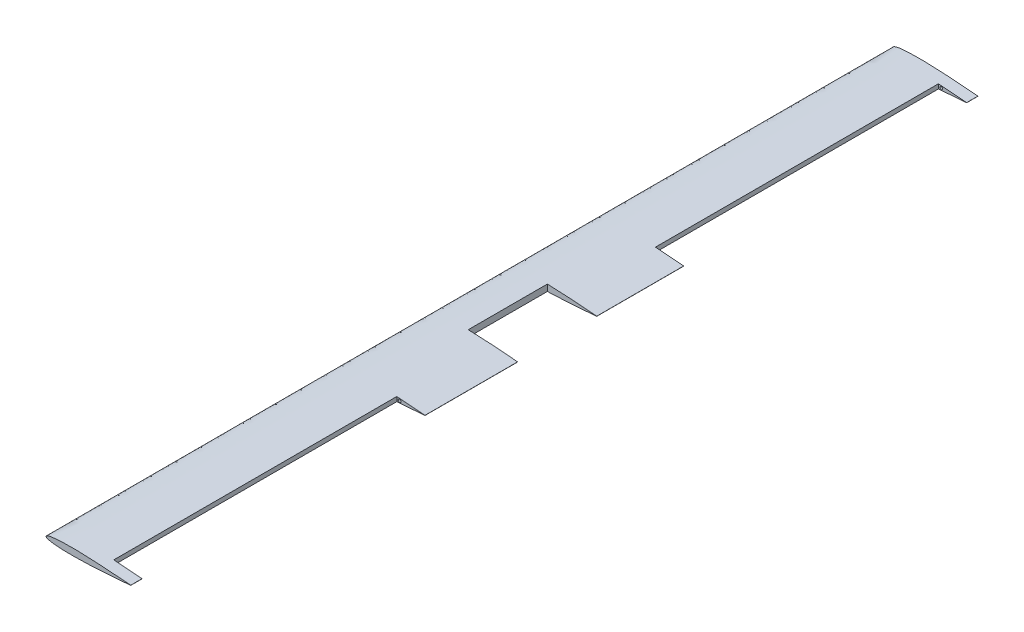
ISO-10303-21;
HEADER;
FILE_DESCRIPTION(('STEP AP214'),'2;1');
FILE_NAME('part.step','',(''),(''),'','','');
FILE_SCHEMA(('AUTOMOTIVE_DESIGN { 1 0 10303 214 1 1 1 1 }'));
ENDSEC;
DATA;
#1=APPLICATION_CONTEXT('core data for automotive mechanical design processes');
#2=APPLICATION_PROTOCOL_DEFINITION('international standard','automotive_design',2000,#1);
#3=PRODUCT_CONTEXT('',#1,'mechanical');
#4=PRODUCT('Part','Part','',(#3));
#5=PRODUCT_RELATED_PRODUCT_CATEGORY('part','',(#4));
#6=PRODUCT_DEFINITION_FORMATION('','',#4);
#7=PRODUCT_DEFINITION_CONTEXT('part definition',#1,'design');
#8=PRODUCT_DEFINITION('design','',#6,#7);
#9=PRODUCT_DEFINITION_SHAPE('','',#8);
#10=(LENGTH_UNIT() NAMED_UNIT(*) SI_UNIT(.MILLI.,.METRE.));
#11=(NAMED_UNIT(*) PLANE_ANGLE_UNIT() SI_UNIT($,.RADIAN.));
#12=(NAMED_UNIT(*) SI_UNIT($,.STERADIAN.) SOLID_ANGLE_UNIT());
#13=UNCERTAINTY_MEASURE_WITH_UNIT(LENGTH_MEASURE(1.E-05),#10,'distance_accuracy_value','');
#14=(GEOMETRIC_REPRESENTATION_CONTEXT(3) GLOBAL_UNCERTAINTY_ASSIGNED_CONTEXT((#13)) GLOBAL_UNIT_ASSIGNED_CONTEXT((#10,
#11,#12)) REPRESENTATION_CONTEXT('',''));
#15=CARTESIAN_POINT('',(0.,0.,0.));
#16=DIRECTION('',(0.,0.,1.));
#17=DIRECTION('',(1.,0.,0.));
#18=AXIS2_PLACEMENT_3D('',#15,#16,#17);
#19=CARTESIAN_POINT('',(87.2529979779286,0.00032362709043763,755.));
#20=DIRECTION('',(0.,0.,-1.));
#21=DIRECTION('',(-1.,0.,0.));
#22=AXIS2_PLACEMENT_3D('',#19,#20,#21);
#23=CYLINDRICAL_SURFACE('',#22,0.178190908859033);
#24=DIRECTION('',(0.,0.,-1.));
#25=VECTOR('',#24,1.);
#26=CARTESIAN_POINT('',(87.3789979779286,0.126323627090438,755.));
#27=LINE('',#26,#25);
#28=CARTESIAN_POINT('',(87.3789979779286,0.126323627090438,-70.0000000000001));
#29=VERTEX_POINT('',#28);
#30=CARTESIAN_POINT('',(87.3789979779286,0.126323627090441,-224.));
#31=VERTEX_POINT('',#30);
#32=EDGE_CURVE('E90',#29,#31,#27,.T.);
#33=ORIENTED_EDGE('',*,*,#32,.F.);
#34=CARTESIAN_POINT('',(87.2529979779286,0.00032362709043763,-70.0000000000001));
#35=DIRECTION('',(0.,0.,-1.));
#36=DIRECTION('',(-1.,0.,0.));
#37=AXIS2_PLACEMENT_3D('',#34,#35,#36);
#38=CIRCLE('',#37,0.178190908859033);
#39=CARTESIAN_POINT('',(87.3789979779286,-0.125676372909566,-70.0000000000001));
#40=VERTEX_POINT('',#39);
#41=EDGE_CURVE('E174',#29,#40,#38,.T.);
#42=ORIENTED_EDGE('',*,*,#41,.T.);
#43=DIRECTION('',(0.,0.,-1.));
#44=VECTOR('',#43,1.);
#45=CARTESIAN_POINT('',(87.3789979779286,-0.125676372909562,755.));
#46=LINE('',#45,#44);
#47=CARTESIAN_POINT('',(87.3789979779286,-0.125676372909566,-224.));
#48=VERTEX_POINT('',#47);
#49=EDGE_CURVE('E120',#40,#48,#46,.T.);
#50=ORIENTED_EDGE('',*,*,#49,.T.);
#51=CARTESIAN_POINT('',(87.2529979779286,0.00032362709043763,-224.));
#52=DIRECTION('',(0.,0.,1.));
#53=DIRECTION('',(1.,0.,0.));
#54=AXIS2_PLACEMENT_3D('',#51,#52,#53);
#55=CIRCLE('',#54,0.178190908859033);
#56=EDGE_CURVE('E178',#48,#31,#55,.T.);
#57=ORIENTED_EDGE('',*,*,#56,.T.);
#58=EDGE_LOOP('',(#33,#42,#50,#57));
#59=FACE_BOUND('',#58,.T.);
#60=ADVANCED_FACE('F38',(#59),#23,.T.);
#61=CARTESIAN_POINT('',(87.2529979779286,0.00032362709043763,-725.));
#62=DIRECTION('',(0.,0.,1.));
#63=DIRECTION('',(1.,0.,0.));
#64=AXIS2_PLACEMENT_3D('',#61,#62,#63);
#65=CIRCLE('',#64,0.178190908859033);
#66=CARTESIAN_POINT('',(87.3789979779286,-0.125676372909566,-725.));
#67=VERTEX_POINT('',#66);
#68=CARTESIAN_POINT('',(87.3789979779286,0.126323627090441,-725.));
#69=VERTEX_POINT('',#68);
#70=EDGE_CURVE('E186',#67,#69,#65,.T.);
#71=ORIENTED_EDGE('',*,*,#70,.F.);
#72=CARTESIAN_POINT('',(87.3789979779286,-0.125676372909562,-745.));
#73=VERTEX_POINT('',#72);
#74=EDGE_CURVE('E96',#67,#73,#46,.T.);
#75=ORIENTED_EDGE('',*,*,#74,.T.);
#76=CARTESIAN_POINT('',(87.2529979779286,0.00032362709043763,-745.));
#77=DIRECTION('',(0.,0.,1.));
#78=DIRECTION('',(-1.,0.,0.));
#79=AXIS2_PLACEMENT_3D('',#76,#77,#78);
#80=CIRCLE('',#79,0.178190908859033);
#81=CARTESIAN_POINT('',(87.3789979779286,0.126323627090438,-745.));
#82=VERTEX_POINT('',#81);
#83=EDGE_CURVE('E94',#73,#82,#80,.T.);
#84=ORIENTED_EDGE('',*,*,#83,.T.);
#85=EDGE_CURVE('E78',#69,#82,#27,.T.);
#86=ORIENTED_EDGE('',*,*,#85,.F.);
#87=EDGE_LOOP('',(#71,#75,#84,#86));
#88=FACE_BOUND('',#87,.T.);
#89=ADVANCED_FACE('F95',(#88),#23,.T.);
#90=CARTESIAN_POINT('',(87.3789979779286,-0.125676372909566,234.));
#91=VERTEX_POINT('',#90);
#92=CARTESIAN_POINT('',(87.3789979779286,-0.125676372909562,70.0000000000001));
#93=VERTEX_POINT('',#92);
#94=EDGE_CURVE('E119',#91,#93,#46,.T.);
#95=ORIENTED_EDGE('',*,*,#94,.T.);
#96=CARTESIAN_POINT('',(87.2529979779286,0.00032362709043763,70.0000000000001));
#97=DIRECTION('',(0.,0.,1.));
#98=DIRECTION('',(1.,0.,0.));
#99=AXIS2_PLACEMENT_3D('',#96,#97,#98);
#100=CIRCLE('',#99,0.178190908859033);
#101=CARTESIAN_POINT('',(87.3789979779286,0.12632362709044,70.0000000000001));
#102=VERTEX_POINT('',#101);
#103=EDGE_CURVE('E165',#93,#102,#100,.T.);
#104=ORIENTED_EDGE('',*,*,#103,.T.);
#105=CARTESIAN_POINT('',(87.3789979779286,0.126323627090441,234.));
#106=VERTEX_POINT('',#105);
#107=EDGE_CURVE('E92',#106,#102,#27,.T.);
#108=ORIENTED_EDGE('',*,*,#107,.F.);
#109=CARTESIAN_POINT('',(87.2529979779286,0.00032362709043763,234.));
#110=DIRECTION('',(0.,0.,1.));
#111=DIRECTION('',(1.,0.,0.));
#112=AXIS2_PLACEMENT_3D('',#109,#110,#111);
#113=CIRCLE('',#112,0.178190908859033);
#114=EDGE_CURVE('E192',#91,#106,#113,.T.);
#115=ORIENTED_EDGE('',*,*,#114,.F.);
#116=EDGE_LOOP('',(#95,#104,#108,#115));
#117=FACE_BOUND('',#116,.T.);
#118=ADVANCED_FACE('F170',(#117),#23,.T.);
#119=CARTESIAN_POINT('',(87.3789979779286,0.126323627090438,755.));
#120=CARTESIAN_POINT('',(84.8792312003281,0.355443347173483,755.));
#121=CARTESIAN_POINT('',(79.8807900660668,0.813582659926846,755.));
#122=CARTESIAN_POINT('',(69.8823374097104,1.66667209732537,755.));
#123=CARTESIAN_POINT('',(57.3839380122584,2.64574011990494,755.));
#124=CARTESIAN_POINT('',(42.3834963781118,3.68711616590649,755.));
#125=CARTESIAN_POINT('',(27.3836549160372,4.59294521231047,755.));
#126=CARTESIAN_POINT('',(12.3835108787313,5.32853244464094,755.));
#127=CARTESIAN_POINT('',(-2.61710418553305,5.854743367679,755.));
#128=CARTESIAN_POINT('',(-15.1205597933054,6.03821385307955,755.));
#129=CARTESIAN_POINT('',(-25.122270121581,5.96572431340267,755.));
#130=CARTESIAN_POINT('',(-32.6243386418961,5.76778822455178,755.));
#131=CARTESIAN_POINT('',(-40.1309573248835,5.38905406501717,755.));
#132=CARTESIAN_POINT('',(-46.3802259247501,4.85680099546454,755.));
#133=CARTESIAN_POINT('',(-51.3874204400673,4.22135567722337,755.));
#134=CARTESIAN_POINT('',(-55.1306100468769,3.60583321602329,755.));
#135=CARTESIAN_POINT('',(-58.346562512321,2.80221186852592,755.));
#136=CARTESIAN_POINT('',(-60.8728817679563,1.9818045048365,755.));
#137=CARTESIAN_POINT('',(-63.6179226982619,0.000323627090447018,755.));
#138=CARTESIAN_POINT('',(-60.8728817679563,-1.98115725065564,755.));
#139=CARTESIAN_POINT('',(-58.346562512321,-2.80156461434503,755.));
#140=CARTESIAN_POINT('',(-55.1306100468769,-3.60518596184242,755.));
#141=CARTESIAN_POINT('',(-51.3874204400673,-4.2207084230425,755.));
#142=CARTESIAN_POINT('',(-46.3802259247501,-4.85615374128366,755.));
#143=CARTESIAN_POINT('',(-40.1309573248835,-5.38840681083629,755.));
#144=CARTESIAN_POINT('',(-32.6243386418962,-5.7671409703709,755.));
#145=CARTESIAN_POINT('',(-25.122270121581,-5.96507705922179,755.));
#146=CARTESIAN_POINT('',(-15.1205597933054,-6.03756659889868,755.));
#147=CARTESIAN_POINT('',(-2.61710418553306,-5.85409611349813,755.));
#148=CARTESIAN_POINT('',(12.3835108787313,-5.32788519046006,755.));
#149=CARTESIAN_POINT('',(27.3836549160372,-4.5922979581296,755.));
#150=CARTESIAN_POINT('',(42.3834963781118,-3.68646891172562,755.));
#151=CARTESIAN_POINT('',(57.3839380122584,-2.64509286572406,755.));
#152=CARTESIAN_POINT('',(69.8823374097105,-1.66602484314449,755.));
#153=CARTESIAN_POINT('',(79.8807900660668,-0.81293540574597,755.));
#154=CARTESIAN_POINT('',(84.8792312003282,-0.354796092992608,755.));
#155=CARTESIAN_POINT('',(87.3789979779286,-0.125676372909562,755.));
#156=B_SPLINE_CURVE_WITH_KNOTS('',3,(#119,#120,#121,#122,#123,#124,#125,#126,#127,#128,#129,
#130,#131,#132,#133,#134,#135,#136,#137,#138,#139,#140,#141,#142,#143,#144,#145,#146,#147,#148,
#149,#150,#151,#152,#153,#154,#155),.UNSPECIFIED.,.F.,.F.,(4,1,1,1,1,1,1,1,1,1,1,1,1,1,1,1,1,1,
1,1,1,1,1,1,1,1,1,1,1,1,1,1,1,1,4),(0.,0.0248762929189861,0.0497417146704997,0.099443402111095,
0.149112224036195,0.198750974066913,0.248359097492202,0.297937369716024,0.347491327096237,
0.37226694027957,0.39705092368842,0.421859474838904,0.446731345826761,0.459220451479858,
0.471790601601357,0.484560454432956,0.491195112481227,0.5,0.508804887518773,0.515439545567044,
0.528209398398643,0.540779548520142,0.553268654173239,0.578140525161096,0.60294907631158,
0.62773305972043,0.652508672903763,0.702062630283976,0.751640902507798,0.801249025933087,
0.850887775963805,0.900556597888905,0.9502582853295,0.975123707081014,1.),.UNSPECIFIED.);
#157=DIRECTION('',(0.,0.,-1.));
#158=VECTOR('',#157,1.);
#159=SURFACE_OF_LINEAR_EXTRUSION('',#156,#158);
#160=DIRECTION('',(0.,0.,-1.));
#161=VECTOR('',#160,1.);
#162=CARTESIAN_POINT('',(0.,5.73405011454422,755.));
#163=LINE('',#162,#161);
#164=CARTESIAN_POINT('',(0.,5.73405011454422,70.));
#165=VERTEX_POINT('',#164);
#166=CARTESIAN_POINT('',(0.,5.73405011454422,-70.));
#167=VERTEX_POINT('',#166);
#168=EDGE_CURVE('E43',#165,#167,#163,.T.);
#169=ORIENTED_EDGE('',*,*,#168,.T.);
#170=CARTESIAN_POINT('',(87.3789979779286,0.126323627090438,-70.0000000000001));
#171=CARTESIAN_POINT('',(84.8792312003281,0.355443347173483,-70.0000000000001));
#172=CARTESIAN_POINT('',(79.8807900660668,0.813582659926846,-70.0000000000001));
#173=CARTESIAN_POINT('',(69.8823374097104,1.66667209732537,-70.0000000000001));
#174=CARTESIAN_POINT('',(57.3839380122584,2.64574011990494,-70.0000000000001));
#175=CARTESIAN_POINT('',(42.3834963781118,3.68711616590649,-70.0000000000001));
#176=CARTESIAN_POINT('',(27.3836549160372,4.59294521231047,-70.0000000000001));
#177=CARTESIAN_POINT('',(12.3835108787313,5.32853244464094,-70.0000000000001));
#178=CARTESIAN_POINT('',(-2.61710418553305,5.854743367679,-70.0000000000001));
#179=CARTESIAN_POINT('',(-15.1205597933054,6.03821385307955,-70.0000000000001));
#180=CARTESIAN_POINT('',(-25.122270121581,5.96572431340267,-70.0000000000001));
#181=CARTESIAN_POINT('',(-32.6243386418961,5.76778822455178,-70.0000000000001));
#182=CARTESIAN_POINT('',(-40.1309573248835,5.38905406501717,-70.0000000000001));
#183=CARTESIAN_POINT('',(-46.3802259247501,4.85680099546454,-70.0000000000001));
#184=CARTESIAN_POINT('',(-51.3874204400673,4.22135567722337,-70.0000000000001));
#185=CARTESIAN_POINT('',(-55.1306100468769,3.60583321602329,-70.0000000000001));
#186=CARTESIAN_POINT('',(-58.346562512321,2.80221186852592,-70.0000000000001));
#187=CARTESIAN_POINT('',(-60.8728817679563,1.9818045048365,-70.0000000000001));
#188=CARTESIAN_POINT('',(-63.6179226982619,0.000323627090447018,-70.0000000000001));
#189=CARTESIAN_POINT('',(-60.8728817679563,-1.98115725065564,-70.0000000000001));
#190=CARTESIAN_POINT('',(-58.346562512321,-2.80156461434503,-70.0000000000001));
#191=CARTESIAN_POINT('',(-55.1306100468769,-3.60518596184242,-70.0000000000001));
#192=CARTESIAN_POINT('',(-51.3874204400673,-4.2207084230425,-70.0000000000001));
#193=CARTESIAN_POINT('',(-46.3802259247501,-4.85615374128366,-70.0000000000001));
#194=CARTESIAN_POINT('',(-40.1309573248835,-5.38840681083629,-70.0000000000001));
#195=CARTESIAN_POINT('',(-32.6243386418962,-5.7671409703709,-70.0000000000001));
#196=CARTESIAN_POINT('',(-25.122270121581,-5.96507705922179,-70.0000000000001));
#197=CARTESIAN_POINT('',(-15.1205597933054,-6.03756659889868,-70.0000000000001));
#198=CARTESIAN_POINT('',(-2.61710418553306,-5.85409611349813,-70.0000000000001));
#199=CARTESIAN_POINT('',(12.3835108787313,-5.32788519046006,-70.0000000000001));
#200=CARTESIAN_POINT('',(27.3836549160372,-4.5922979581296,-70.0000000000001));
#201=CARTESIAN_POINT('',(42.3834963781118,-3.68646891172562,-70.0000000000001));
#202=CARTESIAN_POINT('',(57.3839380122584,-2.64509286572406,-70.0000000000001));
#203=CARTESIAN_POINT('',(69.8823374097105,-1.66602484314449,-70.0000000000001));
#204=CARTESIAN_POINT('',(79.8807900660668,-0.81293540574597,-70.0000000000001));
#205=CARTESIAN_POINT('',(84.8792312003282,-0.354796092992608,-70.0000000000001));
#206=CARTESIAN_POINT('',(87.3789979779286,-0.125676372909562,-70.0000000000001));
#207=B_SPLINE_CURVE_WITH_KNOTS('',3,(#170,#171,#172,#173,#174,#175,#176,#177,#178,#179,#180,
#181,#182,#183,#184,#185,#186,#187,#188,#189,#190,#191,#192,#193,#194,#195,#196,#197,#198,#199,
#200,#201,#202,#203,#204,#205,#206),.UNSPECIFIED.,.F.,.F.,(4,1,1,1,1,1,1,1,1,1,1,1,1,1,1,1,1,1,
1,1,1,1,1,1,1,1,1,1,1,1,1,1,1,1,4),(0.,0.0248762929189861,0.0497417146704997,0.099443402111095,
0.149112224036195,0.198750974066913,0.248359097492202,0.297937369716024,0.347491327096237,
0.37226694027957,0.39705092368842,0.421859474838904,0.446731345826761,0.459220451479858,
0.471790601601357,0.484560454432956,0.491195112481227,0.5,0.508804887518773,0.515439545567044,
0.528209398398643,0.540779548520142,0.553268654173239,0.578140525161096,0.60294907631158,
0.62773305972043,0.652508672903763,0.702062630283976,0.751640902507798,0.801249025933087,
0.850887775963805,0.900556597888905,0.9502582853295,0.975123707081014,1.),.UNSPECIFIED.);
#208=EDGE_CURVE('E11',#167,#29,#207,.F.);
#209=ORIENTED_EDGE('',*,*,#208,.T.);
#210=ORIENTED_EDGE('',*,*,#32,.T.);
#211=CARTESIAN_POINT('',(87.3789979779286,0.126323627090438,-224.));
#212=CARTESIAN_POINT('',(84.8792312003281,0.355443347173483,-224.));
#213=CARTESIAN_POINT('',(79.8807900660668,0.813582659926846,-224.));
#214=CARTESIAN_POINT('',(69.8823374097104,1.66667209732537,-224.));
#215=CARTESIAN_POINT('',(57.3839380122584,2.64574011990494,-224.));
#216=CARTESIAN_POINT('',(42.3834963781118,3.68711616590649,-224.));
#217=CARTESIAN_POINT('',(27.3836549160372,4.59294521231047,-224.));
#218=CARTESIAN_POINT('',(12.3835108787313,5.32853244464094,-224.));
#219=CARTESIAN_POINT('',(-2.61710418553305,5.854743367679,-224.));
#220=CARTESIAN_POINT('',(-15.1205597933054,6.03821385307955,-224.));
#221=CARTESIAN_POINT('',(-25.122270121581,5.96572431340267,-224.));
#222=CARTESIAN_POINT('',(-32.6243386418961,5.76778822455178,-224.));
#223=CARTESIAN_POINT('',(-40.1309573248835,5.38905406501717,-224.));
#224=CARTESIAN_POINT('',(-46.3802259247501,4.85680099546454,-224.));
#225=CARTESIAN_POINT('',(-51.3874204400673,4.22135567722337,-224.));
#226=CARTESIAN_POINT('',(-55.1306100468769,3.60583321602329,-224.));
#227=CARTESIAN_POINT('',(-58.346562512321,2.80221186852592,-224.));
#228=CARTESIAN_POINT('',(-60.8728817679563,1.9818045048365,-224.));
#229=CARTESIAN_POINT('',(-63.6179226982619,0.000323627090447018,-224.));
#230=CARTESIAN_POINT('',(-60.8728817679563,-1.98115725065564,-224.));
#231=CARTESIAN_POINT('',(-58.346562512321,-2.80156461434503,-224.));
#232=CARTESIAN_POINT('',(-55.1306100468769,-3.60518596184242,-224.));
#233=CARTESIAN_POINT('',(-51.3874204400673,-4.2207084230425,-224.));
#234=CARTESIAN_POINT('',(-46.3802259247501,-4.85615374128366,-224.));
#235=CARTESIAN_POINT('',(-40.1309573248835,-5.38840681083629,-224.));
#236=CARTESIAN_POINT('',(-32.6243386418962,-5.7671409703709,-224.));
#237=CARTESIAN_POINT('',(-25.122270121581,-5.96507705922179,-224.));
#238=CARTESIAN_POINT('',(-15.1205597933054,-6.03756659889868,-224.));
#239=CARTESIAN_POINT('',(-2.61710418553306,-5.85409611349813,-224.));
#240=CARTESIAN_POINT('',(12.3835108787313,-5.32788519046006,-224.));
#241=CARTESIAN_POINT('',(27.3836549160372,-4.5922979581296,-224.));
#242=CARTESIAN_POINT('',(42.3834963781118,-3.68646891172562,-224.));
#243=CARTESIAN_POINT('',(57.3839380122584,-2.64509286572406,-224.));
#244=CARTESIAN_POINT('',(69.8823374097105,-1.66602484314449,-224.));
#245=CARTESIAN_POINT('',(79.8807900660668,-0.81293540574597,-224.));
#246=CARTESIAN_POINT('',(84.8792312003282,-0.354796092992608,-224.));
#247=CARTESIAN_POINT('',(87.3789979779286,-0.125676372909562,-224.));
#248=B_SPLINE_CURVE_WITH_KNOTS('',3,(#211,#212,#213,#214,#215,#216,#217,#218,#219,#220,#221,
#222,#223,#224,#225,#226,#227,#228,#229,#230,#231,#232,#233,#234,#235,#236,#237,#238,#239,#240,
#241,#242,#243,#244,#245,#246,#247),.UNSPECIFIED.,.F.,.F.,(4,1,1,1,1,1,1,1,1,1,1,1,1,1,1,1,1,1,
1,1,1,1,1,1,1,1,1,1,1,1,1,1,1,1,4),(0.,0.0248762929189861,0.0497417146704997,0.099443402111095,
0.149112224036195,0.198750974066913,0.248359097492202,0.297937369716024,0.347491327096237,
0.37226694027957,0.39705092368842,0.421859474838904,0.446731345826761,0.459220451479858,
0.471790601601357,0.484560454432956,0.491195112481227,0.5,0.508804887518773,0.515439545567044,
0.528209398398643,0.540779548520142,0.553268654173239,0.578140525161096,0.60294907631158,
0.62773305972043,0.652508672903763,0.702062630283976,0.751640902507798,0.801249025933087,
0.850887775963805,0.900556597888905,0.9502582853295,0.975123707081014,1.),.UNSPECIFIED.);
#249=CARTESIAN_POINT('',(37.3789979779286,3.9815977714079,-224.));
#250=VERTEX_POINT('',#249);
#251=EDGE_CURVE('E223',#250,#31,#248,.F.);
#252=ORIENTED_EDGE('',*,*,#251,.F.);
#253=DIRECTION('',(0.,0.,-1.));
#254=VECTOR('',#253,1.);
#255=CARTESIAN_POINT('',(37.3789979779285,3.98159777261092,755.));
#256=LINE('',#255,#254);
#257=CARTESIAN_POINT('',(37.3789979779287,3.9815977714079,-725.));
#258=VERTEX_POINT('',#257);
#259=EDGE_CURVE('E118',#258,#250,#256,.F.);
#260=ORIENTED_EDGE('',*,*,#259,.F.);
#261=CARTESIAN_POINT('',(87.3789979779286,0.126323627090438,-725.));
#262=CARTESIAN_POINT('',(84.8792312003281,0.355443347173483,-725.));
#263=CARTESIAN_POINT('',(79.8807900660668,0.813582659926846,-725.));
#264=CARTESIAN_POINT('',(69.8823374097104,1.66667209732537,-725.));
#265=CARTESIAN_POINT('',(57.3839380122584,2.64574011990494,-725.));
#266=CARTESIAN_POINT('',(42.3834963781118,3.68711616590649,-725.));
#267=CARTESIAN_POINT('',(27.3836549160372,4.59294521231047,-725.));
#268=CARTESIAN_POINT('',(12.3835108787313,5.32853244464094,-725.));
#269=CARTESIAN_POINT('',(-2.61710418553305,5.854743367679,-725.));
#270=CARTESIAN_POINT('',(-15.1205597933054,6.03821385307955,-725.));
#271=CARTESIAN_POINT('',(-25.122270121581,5.96572431340267,-725.));
#272=CARTESIAN_POINT('',(-32.6243386418961,5.76778822455178,-725.));
#273=CARTESIAN_POINT('',(-40.1309573248835,5.38905406501717,-725.));
#274=CARTESIAN_POINT('',(-46.3802259247501,4.85680099546454,-725.));
#275=CARTESIAN_POINT('',(-51.3874204400673,4.22135567722337,-725.));
#276=CARTESIAN_POINT('',(-55.1306100468769,3.60583321602329,-725.));
#277=CARTESIAN_POINT('',(-58.346562512321,2.80221186852592,-725.));
#278=CARTESIAN_POINT('',(-60.8728817679563,1.9818045048365,-725.));
#279=CARTESIAN_POINT('',(-63.6179226982619,0.000323627090447018,-725.));
#280=CARTESIAN_POINT('',(-60.8728817679563,-1.98115725065564,-725.));
#281=CARTESIAN_POINT('',(-58.346562512321,-2.80156461434503,-725.));
#282=CARTESIAN_POINT('',(-55.1306100468769,-3.60518596184242,-725.));
#283=CARTESIAN_POINT('',(-51.3874204400673,-4.2207084230425,-725.));
#284=CARTESIAN_POINT('',(-46.3802259247501,-4.85615374128366,-725.));
#285=CARTESIAN_POINT('',(-40.1309573248835,-5.38840681083629,-725.));
#286=CARTESIAN_POINT('',(-32.6243386418962,-5.7671409703709,-725.));
#287=CARTESIAN_POINT('',(-25.122270121581,-5.96507705922179,-725.));
#288=CARTESIAN_POINT('',(-15.1205597933054,-6.03756659889868,-725.));
#289=CARTESIAN_POINT('',(-2.61710418553306,-5.85409611349813,-725.));
#290=CARTESIAN_POINT('',(12.3835108787313,-5.32788519046006,-725.));
#291=CARTESIAN_POINT('',(27.3836549160372,-4.5922979581296,-725.));
#292=CARTESIAN_POINT('',(42.3834963781118,-3.68646891172562,-725.));
#293=CARTESIAN_POINT('',(57.3839380122584,-2.64509286572406,-725.));
#294=CARTESIAN_POINT('',(69.8823374097105,-1.66602484314449,-725.));
#295=CARTESIAN_POINT('',(79.8807900660668,-0.81293540574597,-725.));
#296=CARTESIAN_POINT('',(84.8792312003282,-0.354796092992608,-725.));
#297=CARTESIAN_POINT('',(87.3789979779286,-0.125676372909562,-725.));
#298=B_SPLINE_CURVE_WITH_KNOTS('',3,(#261,#262,#263,#264,#265,#266,#267,#268,#269,#270,#271,
#272,#273,#274,#275,#276,#277,#278,#279,#280,#281,#282,#283,#284,#285,#286,#287,#288,#289,#290,
#291,#292,#293,#294,#295,#296,#297),.UNSPECIFIED.,.F.,.F.,(4,1,1,1,1,1,1,1,1,1,1,1,1,1,1,1,1,1,
1,1,1,1,1,1,1,1,1,1,1,1,1,1,1,1,4),(0.,0.0248762929189861,0.0497417146704997,0.099443402111095,
0.149112224036195,0.198750974066913,0.248359097492202,0.297937369716024,0.347491327096237,
0.37226694027957,0.39705092368842,0.421859474838904,0.446731345826761,0.459220451479858,
0.471790601601357,0.484560454432956,0.491195112481227,0.5,0.508804887518773,0.515439545567044,
0.528209398398643,0.540779548520142,0.553268654173239,0.578140525161096,0.60294907631158,
0.62773305972043,0.652508672903763,0.702062630283976,0.751640902507798,0.801249025933087,
0.850887775963805,0.900556597888905,0.9502582853295,0.975123707081014,1.),.UNSPECIFIED.);
#299=EDGE_CURVE('E87',#69,#258,#298,.T.);
#300=ORIENTED_EDGE('',*,*,#299,.F.);
#301=ORIENTED_EDGE('',*,*,#85,.T.);
#302=CARTESIAN_POINT('',(87.3789979779286,0.126323627090438,-745.));
#303=CARTESIAN_POINT('',(84.8792312003281,0.355443347173483,-745.));
#304=CARTESIAN_POINT('',(79.8807900660668,0.813582659926846,-745.));
#305=CARTESIAN_POINT('',(69.8823374097104,1.66667209732537,-745.));
#306=CARTESIAN_POINT('',(57.3839380122584,2.64574011990494,-745.));
#307=CARTESIAN_POINT('',(42.3834963781118,3.68711616590649,-745.));
#308=CARTESIAN_POINT('',(27.3836549160372,4.59294521231047,-745.));
#309=CARTESIAN_POINT('',(12.3835108787313,5.32853244464094,-745.));
#310=CARTESIAN_POINT('',(-2.61710418553305,5.854743367679,-745.));
#311=CARTESIAN_POINT('',(-15.1205597933054,6.03821385307955,-745.));
#312=CARTESIAN_POINT('',(-25.122270121581,5.96572431340267,-745.));
#313=CARTESIAN_POINT('',(-32.6243386418961,5.76778822455178,-745.));
#314=CARTESIAN_POINT('',(-40.1309573248835,5.38905406501717,-745.));
#315=CARTESIAN_POINT('',(-46.3802259247501,4.85680099546454,-745.));
#316=CARTESIAN_POINT('',(-51.3874204400673,4.22135567722337,-745.));
#317=CARTESIAN_POINT('',(-55.1306100468769,3.60583321602329,-745.));
#318=CARTESIAN_POINT('',(-58.346562512321,2.80221186852592,-745.));
#319=CARTESIAN_POINT('',(-60.8728817679563,1.9818045048365,-745.));
#320=CARTESIAN_POINT('',(-63.6179226982619,0.000323627090447018,-745.));
#321=CARTESIAN_POINT('',(-60.8728817679563,-1.98115725065564,-745.));
#322=CARTESIAN_POINT('',(-58.346562512321,-2.80156461434503,-745.));
#323=CARTESIAN_POINT('',(-55.1306100468769,-3.60518596184242,-745.));
#324=CARTESIAN_POINT('',(-51.3874204400673,-4.2207084230425,-745.));
#325=CARTESIAN_POINT('',(-46.3802259247501,-4.85615374128366,-745.));
#326=CARTESIAN_POINT('',(-40.1309573248835,-5.38840681083629,-745.));
#327=CARTESIAN_POINT('',(-32.6243386418962,-5.7671409703709,-745.));
#328=CARTESIAN_POINT('',(-25.122270121581,-5.96507705922179,-745.));
#329=CARTESIAN_POINT('',(-15.1205597933054,-6.03756659889868,-745.));
#330=CARTESIAN_POINT('',(-2.61710418553306,-5.85409611349813,-745.));
#331=CARTESIAN_POINT('',(12.3835108787313,-5.32788519046006,-745.));
#332=CARTESIAN_POINT('',(27.3836549160372,-4.5922979581296,-745.));
#333=CARTESIAN_POINT('',(42.3834963781118,-3.68646891172562,-745.));
#334=CARTESIAN_POINT('',(57.3839380122584,-2.64509286572406,-745.));
#335=CARTESIAN_POINT('',(69.8823374097105,-1.66602484314449,-745.));
#336=CARTESIAN_POINT('',(79.8807900660668,-0.81293540574597,-745.));
#337=CARTESIAN_POINT('',(84.8792312003282,-0.354796092992608,-745.));
#338=CARTESIAN_POINT('',(87.3789979779286,-0.125676372909562,-745.));
#339=B_SPLINE_CURVE_WITH_KNOTS('',3,(#302,#303,#304,#305,#306,#307,#308,#309,#310,#311,#312,
#313,#314,#315,#316,#317,#318,#319,#320,#321,#322,#323,#324,#325,#326,#327,#328,#329,#330,#331,
#332,#333,#334,#335,#336,#337,#338),.UNSPECIFIED.,.F.,.F.,(4,1,1,1,1,1,1,1,1,1,1,1,1,1,1,1,1,1,
1,1,1,1,1,1,1,1,1,1,1,1,1,1,1,1,4),(0.,0.0248762929189861,0.0497417146704997,0.099443402111095,
0.149112224036195,0.198750974066913,0.248359097492202,0.297937369716024,0.347491327096237,
0.37226694027957,0.39705092368842,0.421859474838904,0.446731345826761,0.459220451479858,
0.471790601601357,0.484560454432956,0.491195112481227,0.5,0.508804887518773,0.515439545567044,
0.528209398398643,0.540779548520142,0.553268654173239,0.578140525161096,0.60294907631158,
0.62773305972043,0.652508672903763,0.702062630283976,0.751640902507798,0.801249025933087,
0.850887775963805,0.900556597888905,0.9502582853295,0.975123707081014,1.),.UNSPECIFIED.);
#340=EDGE_CURVE('E83',#82,#73,#339,.T.);
#341=ORIENTED_EDGE('',*,*,#340,.T.);
#342=ORIENTED_EDGE('',*,*,#74,.F.);
#343=CARTESIAN_POINT('',(37.3789979779287,-3.98095051722702,-725.));
#344=VERTEX_POINT('',#343);
#345=EDGE_CURVE('E237',#344,#67,#298,.T.);
#346=ORIENTED_EDGE('',*,*,#345,.F.);
#347=DIRECTION('',(0.,0.,-1.));
#348=VECTOR('',#347,1.);
#349=CARTESIAN_POINT('',(37.3789979779285,-3.98095051843005,755.));
#350=LINE('',#349,#348);
#351=CARTESIAN_POINT('',(37.3789979779286,-3.98095051722703,-224.));
#352=VERTEX_POINT('',#351);
#353=EDGE_CURVE('E123',#352,#344,#350,.T.);
#354=ORIENTED_EDGE('',*,*,#353,.F.);
#355=EDGE_CURVE('E236',#48,#352,#248,.F.);
#356=ORIENTED_EDGE('',*,*,#355,.F.);
#357=ORIENTED_EDGE('',*,*,#49,.F.);
#358=CARTESIAN_POINT('',(0.,-5.73340286036334,-70.));
#359=VERTEX_POINT('',#358);
#360=EDGE_CURVE('E49',#40,#359,#207,.F.);
#361=ORIENTED_EDGE('',*,*,#360,.T.);
#362=DIRECTION('',(0.,0.,-1.));
#363=VECTOR('',#362,1.);
#364=CARTESIAN_POINT('',(1.21105382666631E-13,-5.73340286036334,755.));
#365=LINE('',#364,#363);
#366=CARTESIAN_POINT('',(1.21105382666631E-13,-5.73340286036334,70.0000000000001));
#367=VERTEX_POINT('',#366);
#368=EDGE_CURVE('E132',#359,#367,#365,.F.);
#369=ORIENTED_EDGE('',*,*,#368,.T.);
#370=CARTESIAN_POINT('',(87.3789979779286,0.126323627090438,70.0000000000001));
#371=CARTESIAN_POINT('',(84.8792312003281,0.355443347173483,70.0000000000001));
#372=CARTESIAN_POINT('',(79.8807900660668,0.813582659926846,70.0000000000001));
#373=CARTESIAN_POINT('',(69.8823374097104,1.66667209732537,70.0000000000001));
#374=CARTESIAN_POINT('',(57.3839380122584,2.64574011990494,70.0000000000001));
#375=CARTESIAN_POINT('',(42.3834963781118,3.68711616590649,70.0000000000001));
#376=CARTESIAN_POINT('',(27.3836549160372,4.59294521231047,70.0000000000001));
#377=CARTESIAN_POINT('',(12.3835108787313,5.32853244464094,70.0000000000001));
#378=CARTESIAN_POINT('',(-2.61710418553305,5.854743367679,70.0000000000001));
#379=CARTESIAN_POINT('',(-15.1205597933054,6.03821385307955,70.0000000000001));
#380=CARTESIAN_POINT('',(-25.122270121581,5.96572431340267,70.0000000000001));
#381=CARTESIAN_POINT('',(-32.6243386418961,5.76778822455178,70.0000000000001));
#382=CARTESIAN_POINT('',(-40.1309573248835,5.38905406501717,70.0000000000001));
#383=CARTESIAN_POINT('',(-46.3802259247501,4.85680099546454,70.0000000000001));
#384=CARTESIAN_POINT('',(-51.3874204400673,4.22135567722337,70.0000000000001));
#385=CARTESIAN_POINT('',(-55.1306100468769,3.60583321602329,70.0000000000001));
#386=CARTESIAN_POINT('',(-58.346562512321,2.80221186852592,70.0000000000001));
#387=CARTESIAN_POINT('',(-60.8728817679563,1.9818045048365,70.0000000000001));
#388=CARTESIAN_POINT('',(-63.6179226982619,0.000323627090447018,70.0000000000001));
#389=CARTESIAN_POINT('',(-60.8728817679563,-1.98115725065564,70.0000000000001));
#390=CARTESIAN_POINT('',(-58.346562512321,-2.80156461434503,70.0000000000001));
#391=CARTESIAN_POINT('',(-55.1306100468769,-3.60518596184242,70.0000000000001));
#392=CARTESIAN_POINT('',(-51.3874204400673,-4.2207084230425,70.0000000000001));
#393=CARTESIAN_POINT('',(-46.3802259247501,-4.85615374128366,70.0000000000001));
#394=CARTESIAN_POINT('',(-40.1309573248835,-5.38840681083629,70.0000000000001));
#395=CARTESIAN_POINT('',(-32.6243386418962,-5.7671409703709,70.0000000000001));
#396=CARTESIAN_POINT('',(-25.122270121581,-5.96507705922179,70.0000000000001));
#397=CARTESIAN_POINT('',(-15.1205597933054,-6.03756659889868,70.0000000000001));
#398=CARTESIAN_POINT('',(-2.61710418553306,-5.85409611349813,70.0000000000001));
#399=CARTESIAN_POINT('',(12.3835108787313,-5.32788519046006,70.0000000000001));
#400=CARTESIAN_POINT('',(27.3836549160372,-4.5922979581296,70.0000000000001));
#401=CARTESIAN_POINT('',(42.3834963781118,-3.68646891172562,70.0000000000001));
#402=CARTESIAN_POINT('',(57.3839380122584,-2.64509286572406,70.0000000000001));
#403=CARTESIAN_POINT('',(69.8823374097105,-1.66602484314449,70.0000000000001));
#404=CARTESIAN_POINT('',(79.8807900660668,-0.81293540574597,70.0000000000001));
#405=CARTESIAN_POINT('',(84.8792312003282,-0.354796092992608,70.0000000000001));
#406=CARTESIAN_POINT('',(87.3789979779286,-0.125676372909562,70.0000000000001));
#407=B_SPLINE_CURVE_WITH_KNOTS('',3,(#370,#371,#372,#373,#374,#375,#376,#377,#378,#379,#380,
#381,#382,#383,#384,#385,#386,#387,#388,#389,#390,#391,#392,#393,#394,#395,#396,#397,#398,#399,
#400,#401,#402,#403,#404,#405,#406),.UNSPECIFIED.,.F.,.F.,(4,1,1,1,1,1,1,1,1,1,1,1,1,1,1,1,1,1,
1,1,1,1,1,1,1,1,1,1,1,1,1,1,1,1,4),(0.,0.0248762929189861,0.0497417146704997,0.099443402111095,
0.149112224036195,0.198750974066913,0.248359097492202,0.297937369716024,0.347491327096237,
0.37226694027957,0.39705092368842,0.421859474838904,0.446731345826761,0.459220451479858,
0.471790601601357,0.484560454432956,0.491195112481227,0.5,0.508804887518773,0.515439545567044,
0.528209398398643,0.540779548520142,0.553268654173239,0.578140525161096,0.60294907631158,
0.62773305972043,0.652508672903763,0.702062630283976,0.751640902507798,0.801249025933087,
0.850887775963805,0.900556597888905,0.9502582853295,0.975123707081014,1.),.UNSPECIFIED.);
#408=EDGE_CURVE('E135',#367,#93,#407,.T.);
#409=ORIENTED_EDGE('',*,*,#408,.T.);
#410=ORIENTED_EDGE('',*,*,#94,.F.);
#411=CARTESIAN_POINT('',(87.3789979779286,0.126323627090438,234.));
#412=CARTESIAN_POINT('',(84.8792312003281,0.355443347173483,234.));
#413=CARTESIAN_POINT('',(79.8807900660668,0.813582659926846,234.));
#414=CARTESIAN_POINT('',(69.8823374097104,1.66667209732537,234.));
#415=CARTESIAN_POINT('',(57.3839380122584,2.64574011990494,234.));
#416=CARTESIAN_POINT('',(42.3834963781118,3.68711616590649,234.));
#417=CARTESIAN_POINT('',(27.3836549160372,4.59294521231047,234.));
#418=CARTESIAN_POINT('',(12.3835108787313,5.32853244464094,234.));
#419=CARTESIAN_POINT('',(-2.61710418553305,5.854743367679,234.));
#420=CARTESIAN_POINT('',(-15.1205597933054,6.03821385307955,234.));
#421=CARTESIAN_POINT('',(-25.122270121581,5.96572431340267,234.));
#422=CARTESIAN_POINT('',(-32.6243386418961,5.76778822455178,234.));
#423=CARTESIAN_POINT('',(-40.1309573248835,5.38905406501717,234.));
#424=CARTESIAN_POINT('',(-46.3802259247501,4.85680099546454,234.));
#425=CARTESIAN_POINT('',(-51.3874204400673,4.22135567722337,234.));
#426=CARTESIAN_POINT('',(-55.1306100468769,3.60583321602329,234.));
#427=CARTESIAN_POINT('',(-58.346562512321,2.80221186852592,234.));
#428=CARTESIAN_POINT('',(-60.8728817679563,1.9818045048365,234.));
#429=CARTESIAN_POINT('',(-63.6179226982619,0.000323627090447018,234.));
#430=CARTESIAN_POINT('',(-60.8728817679563,-1.98115725065564,234.));
#431=CARTESIAN_POINT('',(-58.346562512321,-2.80156461434503,234.));
#432=CARTESIAN_POINT('',(-55.1306100468769,-3.60518596184242,234.));
#433=CARTESIAN_POINT('',(-51.3874204400673,-4.2207084230425,234.));
#434=CARTESIAN_POINT('',(-46.3802259247501,-4.85615374128366,234.));
#435=CARTESIAN_POINT('',(-40.1309573248835,-5.38840681083629,234.));
#436=CARTESIAN_POINT('',(-32.6243386418962,-5.7671409703709,234.));
#437=CARTESIAN_POINT('',(-25.122270121581,-5.96507705922179,234.));
#438=CARTESIAN_POINT('',(-15.1205597933054,-6.03756659889868,234.));
#439=CARTESIAN_POINT('',(-2.61710418553306,-5.85409611349813,234.));
#440=CARTESIAN_POINT('',(12.3835108787313,-5.32788519046006,234.));
#441=CARTESIAN_POINT('',(27.3836549160372,-4.5922979581296,234.));
#442=CARTESIAN_POINT('',(42.3834963781118,-3.68646891172562,234.));
#443=CARTESIAN_POINT('',(57.3839380122584,-2.64509286572406,234.));
#444=CARTESIAN_POINT('',(69.8823374097105,-1.66602484314449,234.));
#445=CARTESIAN_POINT('',(79.8807900660668,-0.81293540574597,234.));
#446=CARTESIAN_POINT('',(84.8792312003282,-0.354796092992608,234.));
#447=CARTESIAN_POINT('',(87.3789979779286,-0.125676372909562,234.));
#448=B_SPLINE_CURVE_WITH_KNOTS('',3,(#411,#412,#413,#414,#415,#416,#417,#418,#419,#420,#421,
#422,#423,#424,#425,#426,#427,#428,#429,#430,#431,#432,#433,#434,#435,#436,#437,#438,#439,#440,
#441,#442,#443,#444,#445,#446,#447),.UNSPECIFIED.,.F.,.F.,(4,1,1,1,1,1,1,1,1,1,1,1,1,1,1,1,1,1,
1,1,1,1,1,1,1,1,1,1,1,1,1,1,1,1,4),(0.,0.0248762929189861,0.0497417146704997,0.099443402111095,
0.149112224036195,0.198750974066913,0.248359097492202,0.297937369716024,0.347491327096237,
0.37226694027957,0.39705092368842,0.421859474838904,0.446731345826761,0.459220451479858,
0.471790601601357,0.484560454432956,0.491195112481227,0.5,0.508804887518773,0.515439545567044,
0.528209398398643,0.540779548520142,0.553268654173239,0.578140525161096,0.60294907631158,
0.62773305972043,0.652508672903763,0.702062630283976,0.751640902507798,0.801249025933087,
0.850887775963805,0.900556597888905,0.9502582853295,0.975123707081014,1.),.UNSPECIFIED.);
#449=CARTESIAN_POINT('',(37.3789979779286,-3.98095051722703,234.));
#450=VERTEX_POINT('',#449);
#451=EDGE_CURVE('E251',#91,#450,#448,.F.);
#452=ORIENTED_EDGE('',*,*,#451,.T.);
#453=DIRECTION('',(0.,0.,-1.));
#454=VECTOR('',#453,1.);
#455=CARTESIAN_POINT('',(37.3789979779287,-3.98095051843003,755.));
#456=LINE('',#455,#454);
#457=CARTESIAN_POINT('',(37.3789979779287,-3.98095051843003,735.));
#458=VERTEX_POINT('',#457);
#459=EDGE_CURVE('E129',#450,#458,#456,.F.);
#460=ORIENTED_EDGE('',*,*,#459,.T.);
#461=CARTESIAN_POINT('',(87.3789979779286,0.126323627090438,735.));
#462=CARTESIAN_POINT('',(84.8792312003281,0.355443347173483,735.));
#463=CARTESIAN_POINT('',(79.8807900660668,0.813582659926846,735.));
#464=CARTESIAN_POINT('',(69.8823374097104,1.66667209732537,735.));
#465=CARTESIAN_POINT('',(57.3839380122584,2.64574011990494,735.));
#466=CARTESIAN_POINT('',(42.3834963781118,3.68711616590649,735.));
#467=CARTESIAN_POINT('',(27.3836549160372,4.59294521231047,735.));
#468=CARTESIAN_POINT('',(12.3835108787313,5.32853244464094,735.));
#469=CARTESIAN_POINT('',(-2.61710418553305,5.854743367679,735.));
#470=CARTESIAN_POINT('',(-15.1205597933054,6.03821385307955,735.));
#471=CARTESIAN_POINT('',(-25.122270121581,5.96572431340267,735.));
#472=CARTESIAN_POINT('',(-32.6243386418961,5.76778822455178,735.));
#473=CARTESIAN_POINT('',(-40.1309573248835,5.38905406501717,735.));
#474=CARTESIAN_POINT('',(-46.3802259247501,4.85680099546454,735.));
#475=CARTESIAN_POINT('',(-51.3874204400673,4.22135567722337,735.));
#476=CARTESIAN_POINT('',(-55.1306100468769,3.60583321602329,735.));
#477=CARTESIAN_POINT('',(-58.346562512321,2.80221186852592,735.));
#478=CARTESIAN_POINT('',(-60.8728817679563,1.9818045048365,735.));
#479=CARTESIAN_POINT('',(-63.6179226982619,0.000323627090447018,735.));
#480=CARTESIAN_POINT('',(-60.8728817679563,-1.98115725065564,735.));
#481=CARTESIAN_POINT('',(-58.346562512321,-2.80156461434503,735.));
#482=CARTESIAN_POINT('',(-55.1306100468769,-3.60518596184242,735.));
#483=CARTESIAN_POINT('',(-51.3874204400673,-4.2207084230425,735.));
#484=CARTESIAN_POINT('',(-46.3802259247501,-4.85615374128366,735.));
#485=CARTESIAN_POINT('',(-40.1309573248835,-5.38840681083629,735.));
#486=CARTESIAN_POINT('',(-32.6243386418962,-5.7671409703709,735.));
#487=CARTESIAN_POINT('',(-25.122270121581,-5.96507705922179,735.));
#488=CARTESIAN_POINT('',(-15.1205597933054,-6.03756659889868,735.));
#489=CARTESIAN_POINT('',(-2.61710418553306,-5.85409611349813,735.));
#490=CARTESIAN_POINT('',(12.3835108787313,-5.32788519046006,735.));
#491=CARTESIAN_POINT('',(27.3836549160372,-4.5922979581296,735.));
#492=CARTESIAN_POINT('',(42.3834963781118,-3.68646891172562,735.));
#493=CARTESIAN_POINT('',(57.3839380122584,-2.64509286572406,735.));
#494=CARTESIAN_POINT('',(69.8823374097105,-1.66602484314449,735.));
#495=CARTESIAN_POINT('',(79.8807900660668,-0.81293540574597,735.));
#496=CARTESIAN_POINT('',(84.8792312003282,-0.354796092992608,735.));
#497=CARTESIAN_POINT('',(87.3789979779286,-0.125676372909562,735.));
#498=B_SPLINE_CURVE_WITH_KNOTS('',3,(#461,#462,#463,#464,#465,#466,#467,#468,#469,#470,#471,
#472,#473,#474,#475,#476,#477,#478,#479,#480,#481,#482,#483,#484,#485,#486,#487,#488,#489,#490,
#491,#492,#493,#494,#495,#496,#497),.UNSPECIFIED.,.F.,.F.,(4,1,1,1,1,1,1,1,1,1,1,1,1,1,1,1,1,1,
1,1,1,1,1,1,1,1,1,1,1,1,1,1,1,1,4),(0.,0.0248762929189861,0.0497417146704997,0.099443402111095,
0.149112224036195,0.198750974066913,0.248359097492202,0.297937369716024,0.347491327096237,
0.37226694027957,0.39705092368842,0.421859474838904,0.446731345826761,0.459220451479858,
0.471790601601357,0.484560454432956,0.491195112481227,0.5,0.508804887518773,0.515439545567044,
0.528209398398643,0.540779548520142,0.553268654173239,0.578140525161096,0.60294907631158,
0.62773305972043,0.652508672903763,0.702062630283976,0.751640902507798,0.801249025933087,
0.850887775963805,0.900556597888905,0.9502582853295,0.975123707081014,1.),.UNSPECIFIED.);
#499=CARTESIAN_POINT('',(87.3789979779286,-0.125676372909566,735.));
#500=VERTEX_POINT('',#499);
#501=EDGE_CURVE('E104',#458,#500,#498,.T.);
#502=ORIENTED_EDGE('',*,*,#501,.T.);
#503=CARTESIAN_POINT('',(87.3789979779286,-0.125676372909562,755.));
#504=VERTEX_POINT('',#503);
#505=EDGE_CURVE('E115',#504,#500,#46,.T.);
#506=ORIENTED_EDGE('',*,*,#505,.F.);
#507=CARTESIAN_POINT('',(87.3789979779286,0.126323627090438,755.));
#508=VERTEX_POINT('',#507);
#509=EDGE_CURVE('E98',#508,#504,#156,.T.);
#510=ORIENTED_EDGE('',*,*,#509,.F.);
#511=CARTESIAN_POINT('',(87.3789979779286,0.126323627090441,735.));
#512=VERTEX_POINT('',#511);
#513=EDGE_CURVE('E112',#508,#512,#27,.T.);
#514=ORIENTED_EDGE('',*,*,#513,.T.);
#515=CARTESIAN_POINT('',(37.3789979779287,3.98159777261091,735.));
#516=VERTEX_POINT('',#515);
#517=EDGE_CURVE('E101',#512,#516,#498,.T.);
#518=ORIENTED_EDGE('',*,*,#517,.T.);
#519=DIRECTION('',(0.,0.,-1.));
#520=VECTOR('',#519,1.);
#521=CARTESIAN_POINT('',(37.3789979779287,3.98159777261091,755.));
#522=LINE('',#521,#520);
#523=CARTESIAN_POINT('',(37.3789979779286,3.9815977714079,234.));
#524=VERTEX_POINT('',#523);
#525=EDGE_CURVE('E126',#516,#524,#522,.T.);
#526=ORIENTED_EDGE('',*,*,#525,.T.);
#527=EDGE_CURVE('E245',#524,#106,#448,.F.);
#528=ORIENTED_EDGE('',*,*,#527,.T.);
#529=ORIENTED_EDGE('',*,*,#107,.T.);
#530=EDGE_CURVE('E48',#102,#165,#407,.T.);
#531=ORIENTED_EDGE('',*,*,#530,.T.);
#532=EDGE_LOOP('',(#169,#209,#210,#252,#260,#300,#301,#341,#342,#346,#354,#356,#357,#361,#369,
#409,#410,#452,#460,#502,#506,#510,#514,#518,#526,#528,#529,#531));
#533=FACE_BOUND('',#532,.T.);
#534=ADVANCED_FACE('F40',(#533),#159,.F.);
#535=ORIENTED_EDGE('',*,*,#505,.T.);
#536=CARTESIAN_POINT('',(87.2529979779286,0.00032362709043763,735.));
#537=DIRECTION('',(0.,0.,1.));
#538=DIRECTION('',(1.,0.,0.));
#539=AXIS2_PLACEMENT_3D('',#536,#537,#538);
#540=CIRCLE('',#539,0.178190908859033);
#541=EDGE_CURVE('E189',#500,#512,#540,.T.);
#542=ORIENTED_EDGE('',*,*,#541,.T.);
#543=ORIENTED_EDGE('',*,*,#513,.F.);
#544=CARTESIAN_POINT('',(87.2529979779286,0.00032362709043763,755.));
#545=DIRECTION('',(0.,0.,1.));
#546=DIRECTION('',(-1.,0.,0.));
#547=AXIS2_PLACEMENT_3D('',#544,#545,#546);
#548=CIRCLE('',#547,0.178190908859033);
#549=EDGE_CURVE('E64',#504,#508,#548,.T.);
#550=ORIENTED_EDGE('',*,*,#549,.F.);
#551=EDGE_LOOP('',(#535,#542,#543,#550));
#552=FACE_BOUND('',#551,.T.);
#553=ADVANCED_FACE('F274',(#552),#23,.T.);
#554=CARTESIAN_POINT('',(-62.6210020220714,0.000323627090437566,755.));
#555=DIRECTION('',(0.,0.,-1.));
#556=DIRECTION('',(-1.,0.,0.));
#557=AXIS2_PLACEMENT_3D('',#554,#555,#556);
#558=PLANE('',#557);
#559=ORIENTED_EDGE('',*,*,#509,.T.);
#560=ORIENTED_EDGE('',*,*,#549,.T.);
#561=EDGE_LOOP('',(#559,#560));
#562=FACE_BOUND('',#561,.T.);
#563=ADVANCED_FACE('F269',(#562),#558,.F.);
#564=CARTESIAN_POINT('',(-62.6210020220714,0.000323627090437566,-745.));
#565=DIRECTION('',(0.,0.,-1.));
#566=DIRECTION('',(-1.,0.,0.));
#567=AXIS2_PLACEMENT_3D('',#564,#565,#566);
#568=PLANE('',#567);
#569=ORIENTED_EDGE('',*,*,#340,.F.);
#570=ORIENTED_EDGE('',*,*,#83,.F.);
#571=EDGE_LOOP('',(#569,#570));
#572=FACE_BOUND('',#571,.T.);
#573=ADVANCED_FACE('F100',(#572),#568,.T.);
#574=CARTESIAN_POINT('',(37.3789979779286,-5.,-224.));
#575=DIRECTION('',(1.,0.,0.));
#576=DIRECTION('',(0.,0.,-1.));
#577=AXIS2_PLACEMENT_3D('',#574,#575,#576);
#578=PLANE('',#577);
#579=ORIENTED_EDGE('',*,*,#259,.T.);
#580=DIRECTION('',(0.,1.,0.));
#581=VECTOR('',#580,1.);
#582=CARTESIAN_POINT('',(37.3789979779286,-5.,-224.));
#583=LINE('',#582,#581);
#584=EDGE_CURVE('E227',#352,#250,#583,.T.);
#585=ORIENTED_EDGE('',*,*,#584,.F.);
#586=ORIENTED_EDGE('',*,*,#353,.T.);
#587=DIRECTION('',(0.,1.,0.));
#588=VECTOR('',#587,1.);
#589=CARTESIAN_POINT('',(37.3789979779287,-5.,-725.));
#590=LINE('',#589,#588);
#591=EDGE_CURVE('E217',#344,#258,#590,.T.);
#592=ORIENTED_EDGE('',*,*,#591,.T.);
#593=EDGE_LOOP('',(#579,#585,#586,#592));
#594=FACE_BOUND('',#593,.T.);
#595=ADVANCED_FACE('F405',(#594),#578,.T.);
#596=CARTESIAN_POINT('',(37.3789979779287,-5.,-725.));
#597=DIRECTION('',(0.,0.,1.));
#598=DIRECTION('',(1.,0.,0.));
#599=AXIS2_PLACEMENT_3D('',#596,#597,#598);
#600=PLANE('',#599);
#601=ORIENTED_EDGE('',*,*,#299,.T.);
#602=ORIENTED_EDGE('',*,*,#591,.F.);
#603=ORIENTED_EDGE('',*,*,#345,.T.);
#604=ORIENTED_EDGE('',*,*,#70,.T.);
#605=EDGE_LOOP('',(#601,#602,#603,#604));
#606=FACE_BOUND('',#605,.T.);
#607=CARTESIAN_POINT('',(42.3789979779287,0.000323627090438594,-725.));
#608=DIRECTION('',(0.,0.,1.));
#609=DIRECTION('',(1.,0.,0.));
#610=AXIS2_PLACEMENT_3D('',#607,#608,#609);
#611=CIRCLE('',#610,2.5);
#612=CARTESIAN_POINT('',(44.8789979779287,0.000323627090438594,-725.));
#613=VERTEX_POINT('',#612);
#614=EDGE_CURVE('E199',#613,#613,#611,.T.);
#615=ORIENTED_EDGE('',*,*,#614,.F.);
#616=EDGE_LOOP('',(#615));
#617=FACE_BOUND('',#616,.T.);
#618=ADVANCED_FACE('F402',(#606,#617),#600,.T.);
#619=CARTESIAN_POINT('',(87.3789979779286,-5.,-224.));
#620=DIRECTION('',(0.,0.,-1.));
#621=DIRECTION('',(-1.,0.,0.));
#622=AXIS2_PLACEMENT_3D('',#619,#620,#621);
#623=PLANE('',#622);
#624=ORIENTED_EDGE('',*,*,#355,.T.);
#625=ORIENTED_EDGE('',*,*,#584,.T.);
#626=ORIENTED_EDGE('',*,*,#251,.T.);
#627=ORIENTED_EDGE('',*,*,#56,.F.);
#628=EDGE_LOOP('',(#624,#625,#626,#627));
#629=FACE_BOUND('',#628,.T.);
#630=CARTESIAN_POINT('',(42.3789979779286,0.000323627090435813,-224.));
#631=DIRECTION('',(0.,0.,-1.));
#632=DIRECTION('',(-1.,0.,0.));
#633=AXIS2_PLACEMENT_3D('',#630,#631,#632);
#634=CIRCLE('',#633,2.5);
#635=CARTESIAN_POINT('',(39.8789979779286,0.000323627090435813,-224.));
#636=VERTEX_POINT('',#635);
#637=EDGE_CURVE('E195',#636,#636,#634,.T.);
#638=ORIENTED_EDGE('',*,*,#637,.F.);
#639=EDGE_LOOP('',(#638));
#640=FACE_BOUND('',#639,.T.);
#641=ADVANCED_FACE('F404',(#629,#640),#623,.T.);
#642=CARTESIAN_POINT('',(37.3789979779286,-5.,234.));
#643=DIRECTION('',(-1.,0.,0.));
#644=DIRECTION('',(0.,0.,1.));
#645=AXIS2_PLACEMENT_3D('',#642,#643,#644);
#646=PLANE('',#645);
#647=DIRECTION('',(0.,1.,0.));
#648=VECTOR('',#647,1.);
#649=CARTESIAN_POINT('',(37.3789979779287,-5.,735.));
#650=LINE('',#649,#648);
#651=EDGE_CURVE('E220',#458,#516,#650,.T.);
#652=ORIENTED_EDGE('',*,*,#651,.F.);
#653=ORIENTED_EDGE('',*,*,#459,.F.);
#654=DIRECTION('',(0.,1.,0.));
#655=VECTOR('',#654,1.);
#656=CARTESIAN_POINT('',(37.3789979779286,-5.,234.));
#657=LINE('',#656,#655);
#658=EDGE_CURVE('E224',#450,#524,#657,.T.);
#659=ORIENTED_EDGE('',*,*,#658,.T.);
#660=ORIENTED_EDGE('',*,*,#525,.F.);
#661=EDGE_LOOP('',(#652,#653,#659,#660));
#662=FACE_BOUND('',#661,.T.);
#663=ADVANCED_FACE('F295',(#662),#646,.F.);
#664=CARTESIAN_POINT('',(37.3789979779287,-5.,735.));
#665=DIRECTION('',(0.,0.,1.));
#666=DIRECTION('',(1.,0.,0.));
#667=AXIS2_PLACEMENT_3D('',#664,#665,#666);
#668=PLANE('',#667);
#669=ORIENTED_EDGE('',*,*,#541,.F.);
#670=ORIENTED_EDGE('',*,*,#501,.F.);
#671=ORIENTED_EDGE('',*,*,#651,.T.);
#672=ORIENTED_EDGE('',*,*,#517,.F.);
#673=EDGE_LOOP('',(#669,#670,#671,#672));
#674=FACE_BOUND('',#673,.T.);
#675=CARTESIAN_POINT('',(42.3789979779287,0.000323627090437114,735.));
#676=DIRECTION('',(0.,0.,-1.));
#677=DIRECTION('',(-1.,0.,0.));
#678=AXIS2_PLACEMENT_3D('',#675,#676,#677);
#679=CIRCLE('',#678,2.5);
#680=CARTESIAN_POINT('',(39.8789979779287,0.000323627090437114,735.));
#681=VERTEX_POINT('',#680);
#682=EDGE_CURVE('E205',#681,#681,#679,.T.);
#683=ORIENTED_EDGE('',*,*,#682,.F.);
#684=EDGE_LOOP('',(#683));
#685=FACE_BOUND('',#684,.T.);
#686=ADVANCED_FACE('F298',(#674,#685),#668,.F.);
#687=CARTESIAN_POINT('',(87.3789979779286,-5.,234.));
#688=DIRECTION('',(0.,0.,-1.));
#689=DIRECTION('',(-1.,0.,0.));
#690=AXIS2_PLACEMENT_3D('',#687,#688,#689);
#691=PLANE('',#690);
#692=ORIENTED_EDGE('',*,*,#114,.T.);
#693=ORIENTED_EDGE('',*,*,#527,.F.);
#694=ORIENTED_EDGE('',*,*,#658,.F.);
#695=ORIENTED_EDGE('',*,*,#451,.F.);
#696=EDGE_LOOP('',(#692,#693,#694,#695));
#697=FACE_BOUND('',#696,.T.);
#698=CARTESIAN_POINT('',(42.3789979779286,0.,234.));
#699=DIRECTION('',(0.,0.,1.));
#700=DIRECTION('',(1.,0.,0.));
#701=AXIS2_PLACEMENT_3D('',#698,#699,#700);
#702=CIRCLE('',#701,2.5);
#703=CARTESIAN_POINT('',(44.8789979779286,0.,234.));
#704=VERTEX_POINT('',#703);
#705=EDGE_CURVE('E211',#704,#704,#702,.T.);
#706=ORIENTED_EDGE('',*,*,#705,.F.);
#707=EDGE_LOOP('',(#706));
#708=FACE_BOUND('',#707,.T.);
#709=ADVANCED_FACE('F301',(#697,#708),#691,.F.);
#710=CARTESIAN_POINT('',(42.3789979779286,0.,229.));
#711=DIRECTION('',(0.,0.,1.));
#712=DIRECTION('',(1.,0.,0.));
#713=AXIS2_PLACEMENT_3D('',#710,#711,#712);
#714=CYLINDRICAL_SURFACE('',#713,2.5);
#715=CARTESIAN_POINT('',(42.3789979779286,0.,229.));
#716=DIRECTION('',(0.,0.,1.));
#717=DIRECTION('',(1.,0.,0.));
#718=AXIS2_PLACEMENT_3D('',#715,#716,#717);
#719=CIRCLE('',#718,2.5);
#720=CARTESIAN_POINT('',(44.8789979779286,0.,229.));
#721=VERTEX_POINT('',#720);
#722=EDGE_CURVE('E214',#721,#721,#719,.T.);
#723=ORIENTED_EDGE('',*,*,#722,.F.);
#724=EDGE_LOOP('',(#723));
#725=FACE_BOUND('',#724,.T.);
#726=ORIENTED_EDGE('',*,*,#705,.T.);
#727=EDGE_LOOP('',(#726));
#728=FACE_BOUND('',#727,.T.);
#729=ADVANCED_FACE('F318',(#725,#728),#714,.F.);
#730=CARTESIAN_POINT('',(42.3789979779286,0.,229.));
#731=DIRECTION('',(0.,0.,1.));
#732=DIRECTION('',(1.,0.,0.));
#733=AXIS2_PLACEMENT_3D('',#730,#731,#732);
#734=PLANE('',#733);
#735=ORIENTED_EDGE('',*,*,#722,.T.);
#736=EDGE_LOOP('',(#735));
#737=FACE_BOUND('',#736,.T.);
#738=ADVANCED_FACE('F308',(#737),#734,.T.);
#739=CARTESIAN_POINT('',(42.3789979779287,0.000323627090437114,740.));
#740=DIRECTION('',(0.,0.,-1.));
#741=DIRECTION('',(-1.,0.,0.));
#742=AXIS2_PLACEMENT_3D('',#739,#740,#741);
#743=CYLINDRICAL_SURFACE('',#742,2.5);
#744=CARTESIAN_POINT('',(42.3789979779287,0.000323627090437114,740.));
#745=DIRECTION('',(0.,0.,-1.));
#746=DIRECTION('',(-1.,0.,0.));
#747=AXIS2_PLACEMENT_3D('',#744,#745,#746);
#748=CIRCLE('',#747,2.5);
#749=CARTESIAN_POINT('',(39.8789979779287,0.000323627090437114,740.));
#750=VERTEX_POINT('',#749);
#751=EDGE_CURVE('E208',#750,#750,#748,.T.);
#752=ORIENTED_EDGE('',*,*,#751,.F.);
#753=EDGE_LOOP('',(#752));
#754=FACE_BOUND('',#753,.T.);
#755=ORIENTED_EDGE('',*,*,#682,.T.);
#756=EDGE_LOOP('',(#755));
#757=FACE_BOUND('',#756,.T.);
#758=ADVANCED_FACE('F305',(#754,#757),#743,.F.);
#759=CARTESIAN_POINT('',(42.3789979779287,0.000323627090437114,740.));
#760=DIRECTION('',(0.,0.,-1.));
#761=DIRECTION('',(-1.,0.,0.));
#762=AXIS2_PLACEMENT_3D('',#759,#760,#761);
#763=PLANE('',#762);
#764=ORIENTED_EDGE('',*,*,#751,.T.);
#765=EDGE_LOOP('',(#764));
#766=FACE_BOUND('',#765,.T.);
#767=ADVANCED_FACE('F307',(#766),#763,.T.);
#768=CARTESIAN_POINT('',(42.3789979779287,0.000323627090438594,-730.));
#769=DIRECTION('',(0.,0.,1.));
#770=DIRECTION('',(1.,0.,0.));
#771=AXIS2_PLACEMENT_3D('',#768,#769,#770);
#772=CYLINDRICAL_SURFACE('',#771,2.5);
#773=CARTESIAN_POINT('',(42.3789979779287,0.000323627090438594,-730.));
#774=DIRECTION('',(0.,0.,1.));
#775=DIRECTION('',(1.,0.,0.));
#776=AXIS2_PLACEMENT_3D('',#773,#774,#775);
#777=CIRCLE('',#776,2.5);
#778=CARTESIAN_POINT('',(44.8789979779287,0.000323627090438594,-730.));
#779=VERTEX_POINT('',#778);
#780=EDGE_CURVE('E202',#779,#779,#777,.T.);
#781=ORIENTED_EDGE('',*,*,#780,.F.);
#782=EDGE_LOOP('',(#781));
#783=FACE_BOUND('',#782,.T.);
#784=ORIENTED_EDGE('',*,*,#614,.T.);
#785=EDGE_LOOP('',(#784));
#786=FACE_BOUND('',#785,.T.);
#787=ADVANCED_FACE('F315',(#783,#786),#772,.F.);
#788=CARTESIAN_POINT('',(42.3789979779287,0.000323627090438594,-730.));
#789=DIRECTION('',(0.,0.,1.));
#790=DIRECTION('',(1.,0.,0.));
#791=AXIS2_PLACEMENT_3D('',#788,#789,#790);
#792=PLANE('',#791);
#793=ORIENTED_EDGE('',*,*,#780,.T.);
#794=EDGE_LOOP('',(#793));
#795=FACE_BOUND('',#794,.T.);
#796=ADVANCED_FACE('F389',(#795),#792,.T.);
#797=CARTESIAN_POINT('',(42.3789979779286,0.000323627090435813,-219.));
#798=DIRECTION('',(0.,0.,-1.));
#799=DIRECTION('',(-1.,0.,0.));
#800=AXIS2_PLACEMENT_3D('',#797,#798,#799);
#801=CYLINDRICAL_SURFACE('',#800,2.5);
#802=CARTESIAN_POINT('',(42.3789979779286,0.000323627090435813,-219.));
#803=DIRECTION('',(0.,0.,-1.));
#804=DIRECTION('',(-1.,0.,0.));
#805=AXIS2_PLACEMENT_3D('',#802,#803,#804);
#806=CIRCLE('',#805,2.5);
#807=CARTESIAN_POINT('',(39.8789979779286,0.000323627090435813,-219.));
#808=VERTEX_POINT('',#807);
#809=EDGE_CURVE('E196',#808,#808,#806,.T.);
#810=ORIENTED_EDGE('',*,*,#809,.F.);
#811=EDGE_LOOP('',(#810));
#812=FACE_BOUND('',#811,.T.);
#813=ORIENTED_EDGE('',*,*,#637,.T.);
#814=EDGE_LOOP('',(#813));
#815=FACE_BOUND('',#814,.T.);
#816=ADVANCED_FACE('F385',(#812,#815),#801,.F.);
#817=CARTESIAN_POINT('',(42.3789979779286,0.000323627090435813,-219.));
#818=DIRECTION('',(0.,0.,-1.));
#819=DIRECTION('',(-1.,0.,0.));
#820=AXIS2_PLACEMENT_3D('',#817,#818,#819);
#821=PLANE('',#820);
#822=ORIENTED_EDGE('',*,*,#809,.T.);
#823=EDGE_LOOP('',(#822));
#824=FACE_BOUND('',#823,.T.);
#825=ADVANCED_FACE('F356',(#824),#821,.T.);
#826=CARTESIAN_POINT('',(100.,-15.,-70.));
#827=DIRECTION('',(0.,0.,-1.));
#828=DIRECTION('',(-1.,0.,0.));
#829=AXIS2_PLACEMENT_3D('',#826,#827,#828);
#830=PLANE('',#829);
#831=ORIENTED_EDGE('',*,*,#41,.F.);
#832=ORIENTED_EDGE('',*,*,#208,.F.);
#833=DIRECTION('',(0.,1.,0.));
#834=VECTOR('',#833,1.);
#835=CARTESIAN_POINT('',(0.,-15.,-70.));
#836=LINE('',#835,#834);
#837=EDGE_CURVE('E175',#359,#167,#836,.T.);
#838=ORIENTED_EDGE('',*,*,#837,.F.);
#839=ORIENTED_EDGE('',*,*,#360,.F.);
#840=EDGE_LOOP('',(#831,#832,#838,#839));
#841=FACE_BOUND('',#840,.T.);
#842=ADVANCED_FACE('F351',(#841),#830,.F.);
#843=CARTESIAN_POINT('',(0.,-15.,70.));
#844=DIRECTION('',(0.,0.,1.));
#845=DIRECTION('',(1.,0.,0.));
#846=AXIS2_PLACEMENT_3D('',#843,#844,#845);
#847=PLANE('',#846);
#848=ORIENTED_EDGE('',*,*,#103,.F.);
#849=ORIENTED_EDGE('',*,*,#408,.F.);
#850=DIRECTION('',(0.,1.,0.));
#851=VECTOR('',#850,1.);
#852=CARTESIAN_POINT('',(0.,-15.,70.));
#853=LINE('',#852,#851);
#854=EDGE_CURVE('E56',#367,#165,#853,.T.);
#855=ORIENTED_EDGE('',*,*,#854,.T.);
#856=ORIENTED_EDGE('',*,*,#530,.F.);
#857=EDGE_LOOP('',(#848,#849,#855,#856));
#858=FACE_BOUND('',#857,.T.);
#859=ADVANCED_FACE('F164',(#858),#847,.F.);
#860=CARTESIAN_POINT('',(0.,-15.,0.));
#861=DIRECTION('',(-1.,0.,0.));
#862=DIRECTION('',(0.,0.,1.));
#863=AXIS2_PLACEMENT_3D('',#860,#861,#862);
#864=PLANE('',#863);
#865=ORIENTED_EDGE('',*,*,#854,.F.);
#866=ORIENTED_EDGE('',*,*,#368,.F.);
#867=ORIENTED_EDGE('',*,*,#837,.T.);
#868=ORIENTED_EDGE('',*,*,#168,.F.);
#869=EDGE_LOOP('',(#865,#866,#867,#868));
#870=FACE_BOUND('',#869,.T.);
#871=ADVANCED_FACE('F368',(#870),#864,.F.);
#872=CLOSED_SHELL('',(#60,#89,#118,#534,#553,#563,#573,#595,#618,#641,#663,#686,#709,#729,#738,
#758,#767,#787,#796,#816,#825,#842,#859,#871));
#873=MANIFOLD_SOLID_BREP('B2',#872);
#874=ADVANCED_BREP_SHAPE_REPRESENTATION('',(#18,#873),#14);
#875=SHAPE_DEFINITION_REPRESENTATION(#9,#874);
ENDSEC;
END-ISO-10303-21;
